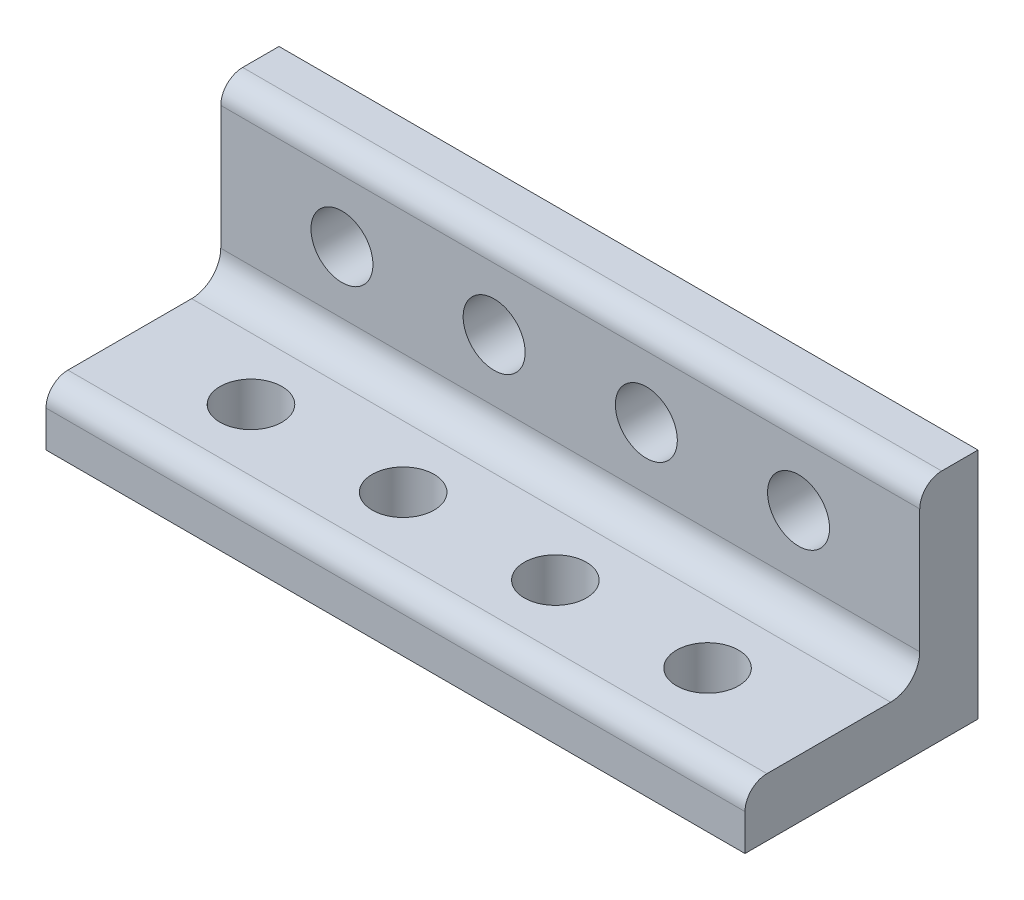
ISO-10303-21;
HEADER;
FILE_DESCRIPTION(('STEP AP214'),'2;1');
FILE_NAME('part.step','',(''),(''),'','','');
FILE_SCHEMA(('AUTOMOTIVE_DESIGN { 1 0 10303 214 1 1 1 1 }'));
ENDSEC;
DATA;
#1=APPLICATION_CONTEXT('core data for automotive mechanical design processes');
#2=APPLICATION_PROTOCOL_DEFINITION('international standard','automotive_design',2000,#1);
#3=PRODUCT_CONTEXT('',#1,'mechanical');
#4=PRODUCT('Part','Part','',(#3));
#5=PRODUCT_RELATED_PRODUCT_CATEGORY('part','',(#4));
#6=PRODUCT_DEFINITION_FORMATION('','',#4);
#7=PRODUCT_DEFINITION_CONTEXT('part definition',#1,'design');
#8=PRODUCT_DEFINITION('design','',#6,#7);
#9=PRODUCT_DEFINITION_SHAPE('','',#8);
#10=(LENGTH_UNIT() NAMED_UNIT(*) SI_UNIT(.MILLI.,.METRE.));
#11=(NAMED_UNIT(*) PLANE_ANGLE_UNIT() SI_UNIT($,.RADIAN.));
#12=(NAMED_UNIT(*) SI_UNIT($,.STERADIAN.) SOLID_ANGLE_UNIT());
#13=UNCERTAINTY_MEASURE_WITH_UNIT(LENGTH_MEASURE(1.E-05),#10,'distance_accuracy_value','');
#14=(GEOMETRIC_REPRESENTATION_CONTEXT(3) GLOBAL_UNCERTAINTY_ASSIGNED_CONTEXT((#13)) GLOBAL_UNIT_ASSIGNED_CONTEXT((#10,
#11,#12)) REPRESENTATION_CONTEXT('',''));
#15=CARTESIAN_POINT('',(0.,0.,0.));
#16=DIRECTION('',(0.,0.,1.));
#17=DIRECTION('',(1.,0.,0.));
#18=AXIS2_PLACEMENT_3D('',#15,#16,#17);
#19=CARTESIAN_POINT('',(0.,6.35,0.));
#20=DIRECTION('',(0.,-1.,0.));
#21=DIRECTION('',(0.,0.,-1.));
#22=AXIS2_PLACEMENT_3D('',#19,#20,#21);
#23=PLANE('',#22);
#24=CARTESIAN_POINT('',(29.80436,6.35,-9.13129999999999));
#25=DIRECTION('',(0.,1.,0.));
#26=DIRECTION('',(0.,0.,1.));
#27=AXIS2_PLACEMENT_3D('',#24,#25,#26);
#28=CIRCLE('',#27,3.3782);
#29=CARTESIAN_POINT('',(29.80436,6.35,-5.75309999999999));
#30=VERTEX_POINT('',#29);
#31=EDGE_CURVE('E304',#30,#30,#28,.T.);
#32=ORIENTED_EDGE('',*,*,#31,.F.);
#33=EDGE_LOOP('',(#32));
#34=FACE_BOUND('',#33,.T.);
#35=CARTESIAN_POINT('',(46.39564,6.35,-9.13129999999999));
#36=DIRECTION('',(0.,1.,0.));
#37=DIRECTION('',(0.,0.,1.));
#38=AXIS2_PLACEMENT_3D('',#35,#36,#37);
#39=CIRCLE('',#38,3.3782);
#40=CARTESIAN_POINT('',(46.39564,6.35,-5.75309999999999));
#41=VERTEX_POINT('',#40);
#42=EDGE_CURVE('E310',#41,#41,#39,.T.);
#43=ORIENTED_EDGE('',*,*,#42,.F.);
#44=EDGE_LOOP('',(#43));
#45=FACE_BOUND('',#44,.T.);
#46=CARTESIAN_POINT('',(62.98692,6.35,-9.13129999999999));
#47=DIRECTION('',(0.,1.,0.));
#48=DIRECTION('',(0.,0.,1.));
#49=AXIS2_PLACEMENT_3D('',#46,#47,#48);
#50=CIRCLE('',#49,3.37819999999999);
#51=CARTESIAN_POINT('',(62.98692,6.35,-5.7531));
#52=VERTEX_POINT('',#51);
#53=EDGE_CURVE('E298',#52,#52,#50,.T.);
#54=ORIENTED_EDGE('',*,*,#53,.F.);
#55=EDGE_LOOP('',(#54));
#56=FACE_BOUND('',#55,.T.);
#57=CARTESIAN_POINT('',(13.21308,6.35,-9.1313));
#58=DIRECTION('',(0.,1.,0.));
#59=DIRECTION('',(0.,0.,1.));
#60=AXIS2_PLACEMENT_3D('',#57,#58,#59);
#61=CIRCLE('',#60,3.37819999999999);
#62=CARTESIAN_POINT('',(13.21308,6.35,-5.7531));
#63=VERTEX_POINT('',#62);
#64=EDGE_CURVE('E133',#63,#63,#61,.T.);
#65=ORIENTED_EDGE('',*,*,#64,.F.);
#66=EDGE_LOOP('',(#65));
#67=FACE_BOUND('',#66,.T.);
#68=DIRECTION('',(0.,0.,1.));
#69=VECTOR('',#68,1.);
#70=CARTESIAN_POINT('',(0.,6.35,0.));
#71=LINE('',#70,#69);
#72=CARTESIAN_POINT('',(0.,6.35,-15.875));
#73=VERTEX_POINT('',#72);
#74=CARTESIAN_POINT('',(0.,6.35,-2.3876));
#75=VERTEX_POINT('',#74);
#76=EDGE_CURVE('E139',#73,#75,#71,.T.);
#77=ORIENTED_EDGE('',*,*,#76,.T.);
#78=DIRECTION('',(1.,0.,0.));
#79=VECTOR('',#78,1.);
#80=CARTESIAN_POINT('',(0.,6.35,-2.3876));
#81=LINE('',#80,#79);
#82=CARTESIAN_POINT('',(76.2,6.35,-2.3876));
#83=VERTEX_POINT('',#82);
#84=EDGE_CURVE('E165',#75,#83,#81,.T.);
#85=ORIENTED_EDGE('',*,*,#84,.T.);
#86=DIRECTION('',(0.,0.,-1.));
#87=VECTOR('',#86,1.);
#88=CARTESIAN_POINT('',(76.2,6.35,0.));
#89=LINE('',#88,#87);
#90=CARTESIAN_POINT('',(76.2,6.35,-15.875));
#91=VERTEX_POINT('',#90);
#92=EDGE_CURVE('E123',#83,#91,#89,.T.);
#93=ORIENTED_EDGE('',*,*,#92,.T.);
#94=DIRECTION('',(1.,0.,0.));
#95=VECTOR('',#94,1.);
#96=CARTESIAN_POINT('',(0.,6.35,-15.875));
#97=LINE('',#96,#95);
#98=EDGE_CURVE('E158',#91,#73,#97,.F.);
#99=ORIENTED_EDGE('',*,*,#98,.T.);
#100=EDGE_LOOP('',(#77,#85,#93,#99));
#101=FACE_BOUND('',#100,.T.);
#102=ADVANCED_FACE('F32',(#34,#45,#56,#67,#101),#23,.F.);
#103=CARTESIAN_POINT('',(0.,6.35,0.));
#104=DIRECTION('',(1.,0.,0.));
#105=DIRECTION('',(0.,0.,-1.));
#106=AXIS2_PLACEMENT_3D('',#103,#104,#105);
#107=PLANE('',#106);
#108=DIRECTION('',(0.,-1.,0.));
#109=VECTOR('',#108,1.);
#110=CARTESIAN_POINT('',(0.,6.35,0.));
#111=LINE('',#110,#109);
#112=CARTESIAN_POINT('',(0.,3.9624,0.));
#113=VERTEX_POINT('',#112);
#114=CARTESIAN_POINT('',(0.,0.,0.));
#115=VERTEX_POINT('',#114);
#116=EDGE_CURVE('E153',#113,#115,#111,.T.);
#117=ORIENTED_EDGE('',*,*,#116,.F.);
#118=CARTESIAN_POINT('',(0.,3.9624,-2.3876));
#119=DIRECTION('',(1.,0.,0.));
#120=DIRECTION('',(0.,0.,-1.));
#121=AXIS2_PLACEMENT_3D('',#118,#119,#120);
#122=CIRCLE('',#121,2.3876);
#123=EDGE_CURVE('E175',#113,#75,#122,.F.);
#124=ORIENTED_EDGE('',*,*,#123,.T.);
#125=ORIENTED_EDGE('',*,*,#76,.F.);
#126=CARTESIAN_POINT('',(0.,9.525,-15.875));
#127=DIRECTION('',(1.,0.,0.));
#128=DIRECTION('',(0.,0.,-1.));
#129=AXIS2_PLACEMENT_3D('',#126,#127,#128);
#130=CIRCLE('',#129,3.175);
#131=CARTESIAN_POINT('',(0.,9.525,-19.05));
#132=VERTEX_POINT('',#131);
#133=EDGE_CURVE('E163',#73,#132,#130,.T.);
#134=ORIENTED_EDGE('',*,*,#133,.T.);
#135=DIRECTION('',(0.,1.,0.));
#136=VECTOR('',#135,1.);
#137=CARTESIAN_POINT('',(0.,0.,-19.05));
#138=LINE('',#137,#136);
#139=CARTESIAN_POINT('',(0.,23.0124,-19.05));
#140=VERTEX_POINT('',#139);
#141=EDGE_CURVE('E128',#132,#140,#138,.T.);
#142=ORIENTED_EDGE('',*,*,#141,.T.);
#143=CARTESIAN_POINT('',(0.,23.0124,-21.4376));
#144=DIRECTION('',(1.,0.,0.));
#145=DIRECTION('',(0.,0.,-1.));
#146=AXIS2_PLACEMENT_3D('',#143,#144,#145);
#147=CIRCLE('',#146,2.3876);
#148=CARTESIAN_POINT('',(0.,25.4,-21.4376));
#149=VERTEX_POINT('',#148);
#150=EDGE_CURVE('E47',#140,#149,#147,.F.);
#151=ORIENTED_EDGE('',*,*,#150,.T.);
#152=DIRECTION('',(0.,0.,-1.));
#153=VECTOR('',#152,1.);
#154=CARTESIAN_POINT('',(0.,25.4,-19.05));
#155=LINE('',#154,#153);
#156=CARTESIAN_POINT('',(0.,25.4,-25.4));
#157=VERTEX_POINT('',#156);
#158=EDGE_CURVE('E101',#149,#157,#155,.T.);
#159=ORIENTED_EDGE('',*,*,#158,.T.);
#160=DIRECTION('',(0.,-1.,0.));
#161=VECTOR('',#160,1.);
#162=CARTESIAN_POINT('',(0.,6.35,-25.4));
#163=LINE('',#162,#161);
#164=CARTESIAN_POINT('',(0.,0.,-25.4));
#165=VERTEX_POINT('',#164);
#166=EDGE_CURVE('E106',#157,#165,#163,.T.);
#167=ORIENTED_EDGE('',*,*,#166,.T.);
#168=DIRECTION('',(0.,0.,1.));
#169=VECTOR('',#168,1.);
#170=CARTESIAN_POINT('',(0.,0.,0.));
#171=LINE('',#170,#169);
#172=EDGE_CURVE('E137',#165,#115,#171,.T.);
#173=ORIENTED_EDGE('',*,*,#172,.T.);
#174=EDGE_LOOP('',(#117,#124,#125,#134,#142,#151,#159,#167,#173));
#175=FACE_BOUND('',#174,.T.);
#176=ADVANCED_FACE('F104',(#175),#107,.F.);
#177=CARTESIAN_POINT('',(0.,6.35,0.));
#178=DIRECTION('',(0.,0.,-1.));
#179=DIRECTION('',(-1.,0.,0.));
#180=AXIS2_PLACEMENT_3D('',#177,#178,#179);
#181=PLANE('',#180);
#182=DIRECTION('',(0.,-1.,0.));
#183=VECTOR('',#182,1.);
#184=CARTESIAN_POINT('',(76.2,6.35,0.));
#185=LINE('',#184,#183);
#186=CARTESIAN_POINT('',(76.2,3.9624,0.));
#187=VERTEX_POINT('',#186);
#188=CARTESIAN_POINT('',(76.2,0.,0.));
#189=VERTEX_POINT('',#188);
#190=EDGE_CURVE('E151',#187,#189,#185,.T.);
#191=ORIENTED_EDGE('',*,*,#190,.F.);
#192=DIRECTION('',(1.,0.,0.));
#193=VECTOR('',#192,1.);
#194=CARTESIAN_POINT('',(0.,3.9624,0.));
#195=LINE('',#194,#193);
#196=EDGE_CURVE('E172',#187,#113,#195,.F.);
#197=ORIENTED_EDGE('',*,*,#196,.T.);
#198=ORIENTED_EDGE('',*,*,#116,.T.);
#199=DIRECTION('',(1.,0.,0.));
#200=VECTOR('',#199,1.);
#201=CARTESIAN_POINT('',(0.,0.,0.));
#202=LINE('',#201,#200);
#203=EDGE_CURVE('E144',#115,#189,#202,.T.);
#204=ORIENTED_EDGE('',*,*,#203,.T.);
#205=EDGE_LOOP('',(#191,#197,#198,#204));
#206=FACE_BOUND('',#205,.T.);
#207=ADVANCED_FACE('F215',(#206),#181,.F.);
#208=CARTESIAN_POINT('',(76.2,6.35,0.));
#209=DIRECTION('',(-1.,0.,0.));
#210=DIRECTION('',(0.,0.,1.));
#211=AXIS2_PLACEMENT_3D('',#208,#209,#210);
#212=PLANE('',#211);
#213=ORIENTED_EDGE('',*,*,#92,.F.);
#214=CARTESIAN_POINT('',(76.2,3.9624,-2.3876));
#215=DIRECTION('',(-1.,0.,0.));
#216=DIRECTION('',(0.,0.,1.));
#217=AXIS2_PLACEMENT_3D('',#214,#215,#216);
#218=CIRCLE('',#217,2.3876);
#219=EDGE_CURVE('E170',#83,#187,#218,.F.);
#220=ORIENTED_EDGE('',*,*,#219,.T.);
#221=ORIENTED_EDGE('',*,*,#190,.T.);
#222=DIRECTION('',(0.,0.,-1.));
#223=VECTOR('',#222,1.);
#224=CARTESIAN_POINT('',(76.2,0.,0.));
#225=LINE('',#224,#223);
#226=CARTESIAN_POINT('',(76.2,0.,-25.4));
#227=VERTEX_POINT('',#226);
#228=EDGE_CURVE('E147',#189,#227,#225,.T.);
#229=ORIENTED_EDGE('',*,*,#228,.T.);
#230=DIRECTION('',(0.,-1.,0.));
#231=VECTOR('',#230,1.);
#232=CARTESIAN_POINT('',(76.2,6.35,-25.4));
#233=LINE('',#232,#231);
#234=CARTESIAN_POINT('',(76.2,25.4,-25.4));
#235=VERTEX_POINT('',#234);
#236=EDGE_CURVE('E122',#235,#227,#233,.T.);
#237=ORIENTED_EDGE('',*,*,#236,.F.);
#238=DIRECTION('',(0.,0.,-1.));
#239=VECTOR('',#238,1.);
#240=CARTESIAN_POINT('',(76.2,25.4,-19.05));
#241=LINE('',#240,#239);
#242=CARTESIAN_POINT('',(76.2,25.4,-21.4376));
#243=VERTEX_POINT('',#242);
#244=EDGE_CURVE('E112',#243,#235,#241,.T.);
#245=ORIENTED_EDGE('',*,*,#244,.F.);
#246=CARTESIAN_POINT('',(76.2,23.0124,-21.4376));
#247=DIRECTION('',(-1.,0.,0.));
#248=DIRECTION('',(0.,0.,1.));
#249=AXIS2_PLACEMENT_3D('',#246,#247,#248);
#250=CIRCLE('',#249,2.3876);
#251=CARTESIAN_POINT('',(76.2,23.0124,-19.05));
#252=VERTEX_POINT('',#251);
#253=EDGE_CURVE('E168',#243,#252,#250,.F.);
#254=ORIENTED_EDGE('',*,*,#253,.T.);
#255=DIRECTION('',(0.,-1.,0.));
#256=VECTOR('',#255,1.);
#257=CARTESIAN_POINT('',(76.2,0.,-19.05));
#258=LINE('',#257,#256);
#259=CARTESIAN_POINT('',(76.2,9.525,-19.05));
#260=VERTEX_POINT('',#259);
#261=EDGE_CURVE('E113',#252,#260,#258,.T.);
#262=ORIENTED_EDGE('',*,*,#261,.T.);
#263=CARTESIAN_POINT('',(76.2,9.525,-15.875));
#264=DIRECTION('',(-1.,0.,0.));
#265=DIRECTION('',(0.,0.,1.));
#266=AXIS2_PLACEMENT_3D('',#263,#264,#265);
#267=CIRCLE('',#266,3.175);
#268=EDGE_CURVE('E160',#260,#91,#267,.T.);
#269=ORIENTED_EDGE('',*,*,#268,.T.);
#270=EDGE_LOOP('',(#213,#220,#221,#229,#237,#245,#254,#262,#269));
#271=FACE_BOUND('',#270,.T.);
#272=ADVANCED_FACE('F179',(#271),#212,.F.);
#273=CARTESIAN_POINT('',(0.,6.35,-25.4));
#274=DIRECTION('',(0.,0.,1.));
#275=DIRECTION('',(1.,0.,0.));
#276=AXIS2_PLACEMENT_3D('',#273,#274,#275);
#277=PLANE('',#276);
#278=CARTESIAN_POINT('',(29.80436,16.2687,-25.4));
#279=DIRECTION('',(0.,0.,1.));
#280=DIRECTION('',(1.,0.,0.));
#281=AXIS2_PLACEMENT_3D('',#278,#279,#280);
#282=CIRCLE('',#281,3.3782);
#283=CARTESIAN_POINT('',(33.18256,16.2687,-25.4));
#284=VERTEX_POINT('',#283);
#285=EDGE_CURVE('E276',#284,#284,#282,.T.);
#286=ORIENTED_EDGE('',*,*,#285,.T.);
#287=EDGE_LOOP('',(#286));
#288=FACE_BOUND('',#287,.T.);
#289=CARTESIAN_POINT('',(46.39564,16.2687,-25.4));
#290=DIRECTION('',(0.,0.,1.));
#291=DIRECTION('',(1.,0.,0.));
#292=AXIS2_PLACEMENT_3D('',#289,#290,#291);
#293=CIRCLE('',#292,3.3782);
#294=CARTESIAN_POINT('',(49.77384,16.2687,-25.4));
#295=VERTEX_POINT('',#294);
#296=EDGE_CURVE('E279',#295,#295,#293,.T.);
#297=ORIENTED_EDGE('',*,*,#296,.T.);
#298=EDGE_LOOP('',(#297));
#299=FACE_BOUND('',#298,.T.);
#300=CARTESIAN_POINT('',(62.98692,16.2687,-25.4));
#301=DIRECTION('',(0.,0.,1.));
#302=DIRECTION('',(1.,0.,0.));
#303=AXIS2_PLACEMENT_3D('',#300,#301,#302);
#304=CIRCLE('',#303,3.37819999999999);
#305=CARTESIAN_POINT('',(66.36512,16.2687,-25.4));
#306=VERTEX_POINT('',#305);
#307=EDGE_CURVE('E289',#306,#306,#304,.T.);
#308=ORIENTED_EDGE('',*,*,#307,.T.);
#309=EDGE_LOOP('',(#308));
#310=FACE_BOUND('',#309,.T.);
#311=CARTESIAN_POINT('',(13.21308,16.2687,-25.4));
#312=DIRECTION('',(0.,0.,1.));
#313=DIRECTION('',(1.,0.,0.));
#314=AXIS2_PLACEMENT_3D('',#311,#312,#313);
#315=CIRCLE('',#314,3.3782);
#316=CARTESIAN_POINT('',(16.59128,16.2687,-25.4));
#317=VERTEX_POINT('',#316);
#318=EDGE_CURVE('E295',#317,#317,#315,.T.);
#319=ORIENTED_EDGE('',*,*,#318,.T.);
#320=EDGE_LOOP('',(#319));
#321=FACE_BOUND('',#320,.T.);
#322=DIRECTION('',(-1.,0.,0.));
#323=VECTOR('',#322,1.);
#324=CARTESIAN_POINT('',(0.,0.,-25.4));
#325=LINE('',#324,#323);
#326=EDGE_CURVE('E121',#227,#165,#325,.T.);
#327=ORIENTED_EDGE('',*,*,#326,.T.);
#328=ORIENTED_EDGE('',*,*,#166,.F.);
#329=DIRECTION('',(1.,0.,0.));
#330=VECTOR('',#329,1.);
#331=CARTESIAN_POINT('',(0.,25.4,-25.4));
#332=LINE('',#331,#330);
#333=EDGE_CURVE('E119',#157,#235,#332,.T.);
#334=ORIENTED_EDGE('',*,*,#333,.T.);
#335=ORIENTED_EDGE('',*,*,#236,.T.);
#336=EDGE_LOOP('',(#327,#328,#334,#335));
#337=FACE_BOUND('',#336,.T.);
#338=ADVANCED_FACE('F117',(#288,#299,#310,#321,#337),#277,.F.);
#339=CARTESIAN_POINT('',(0.,0.,0.));
#340=DIRECTION('',(0.,-1.,0.));
#341=DIRECTION('',(0.,0.,-1.));
#342=AXIS2_PLACEMENT_3D('',#339,#340,#341);
#343=PLANE('',#342);
#344=CARTESIAN_POINT('',(29.80436,0.,-9.13129999999999));
#345=DIRECTION('',(0.,1.,0.));
#346=DIRECTION('',(0.,0.,1.));
#347=AXIS2_PLACEMENT_3D('',#344,#345,#346);
#348=CIRCLE('',#347,3.3782);
#349=CARTESIAN_POINT('',(29.80436,0.,-5.75309999999999));
#350=VERTEX_POINT('',#349);
#351=EDGE_CURVE('E301',#350,#350,#348,.T.);
#352=ORIENTED_EDGE('',*,*,#351,.T.);
#353=EDGE_LOOP('',(#352));
#354=FACE_BOUND('',#353,.T.);
#355=CARTESIAN_POINT('',(46.39564,0.,-9.13129999999999));
#356=DIRECTION('',(0.,1.,0.));
#357=DIRECTION('',(0.,0.,1.));
#358=AXIS2_PLACEMENT_3D('',#355,#356,#357);
#359=CIRCLE('',#358,3.3782);
#360=CARTESIAN_POINT('',(46.39564,0.,-5.75309999999999));
#361=VERTEX_POINT('',#360);
#362=EDGE_CURVE('E307',#361,#361,#359,.T.);
#363=ORIENTED_EDGE('',*,*,#362,.T.);
#364=EDGE_LOOP('',(#363));
#365=FACE_BOUND('',#364,.T.);
#366=CARTESIAN_POINT('',(62.98692,0.,-9.13129999999999));
#367=DIRECTION('',(0.,1.,0.));
#368=DIRECTION('',(0.,0.,1.));
#369=AXIS2_PLACEMENT_3D('',#366,#367,#368);
#370=CIRCLE('',#369,3.37819999999999);
#371=CARTESIAN_POINT('',(62.98692,0.,-5.7531));
#372=VERTEX_POINT('',#371);
#373=EDGE_CURVE('E313',#372,#372,#370,.T.);
#374=ORIENTED_EDGE('',*,*,#373,.T.);
#375=EDGE_LOOP('',(#374));
#376=FACE_BOUND('',#375,.T.);
#377=CARTESIAN_POINT('',(13.21308,0.,-9.1313));
#378=DIRECTION('',(0.,1.,0.));
#379=DIRECTION('',(0.,0.,1.));
#380=AXIS2_PLACEMENT_3D('',#377,#378,#379);
#381=CIRCLE('',#380,3.37819999999999);
#382=CARTESIAN_POINT('',(13.21308,0.,-5.7531));
#383=VERTEX_POINT('',#382);
#384=EDGE_CURVE('E129',#383,#383,#381,.T.);
#385=ORIENTED_EDGE('',*,*,#384,.T.);
#386=EDGE_LOOP('',(#385));
#387=FACE_BOUND('',#386,.T.);
#388=ORIENTED_EDGE('',*,*,#326,.F.);
#389=ORIENTED_EDGE('',*,*,#228,.F.);
#390=ORIENTED_EDGE('',*,*,#203,.F.);
#391=ORIENTED_EDGE('',*,*,#172,.F.);
#392=EDGE_LOOP('',(#388,#389,#390,#391));
#393=FACE_BOUND('',#392,.T.);
#394=ADVANCED_FACE('F182',(#354,#365,#376,#387,#393),#343,.T.);
#395=CARTESIAN_POINT('',(0.,0.,-19.05));
#396=DIRECTION('',(0.,0.,-1.));
#397=DIRECTION('',(-1.,0.,0.));
#398=AXIS2_PLACEMENT_3D('',#395,#396,#397);
#399=PLANE('',#398);
#400=CARTESIAN_POINT('',(29.80436,16.2687,-19.05));
#401=DIRECTION('',(0.,0.,1.));
#402=DIRECTION('',(1.,0.,0.));
#403=AXIS2_PLACEMENT_3D('',#400,#401,#402);
#404=CIRCLE('',#403,3.3782);
#405=CARTESIAN_POINT('',(33.18256,16.2687,-19.05));
#406=VERTEX_POINT('',#405);
#407=EDGE_CURVE('E278',#406,#406,#404,.T.);
#408=ORIENTED_EDGE('',*,*,#407,.F.);
#409=EDGE_LOOP('',(#408));
#410=FACE_BOUND('',#409,.T.);
#411=CARTESIAN_POINT('',(46.39564,16.2687,-19.05));
#412=DIRECTION('',(0.,0.,1.));
#413=DIRECTION('',(1.,0.,0.));
#414=AXIS2_PLACEMENT_3D('',#411,#412,#413);
#415=CIRCLE('',#414,3.3782);
#416=CARTESIAN_POINT('',(49.77384,16.2687,-19.05));
#417=VERTEX_POINT('',#416);
#418=EDGE_CURVE('E284',#417,#417,#415,.T.);
#419=ORIENTED_EDGE('',*,*,#418,.F.);
#420=EDGE_LOOP('',(#419));
#421=FACE_BOUND('',#420,.T.);
#422=CARTESIAN_POINT('',(62.98692,16.2687,-19.05));
#423=DIRECTION('',(0.,0.,1.));
#424=DIRECTION('',(1.,0.,0.));
#425=AXIS2_PLACEMENT_3D('',#422,#423,#424);
#426=CIRCLE('',#425,3.37819999999999);
#427=CARTESIAN_POINT('',(66.36512,16.2687,-19.05));
#428=VERTEX_POINT('',#427);
#429=EDGE_CURVE('E292',#428,#428,#426,.T.);
#430=ORIENTED_EDGE('',*,*,#429,.F.);
#431=EDGE_LOOP('',(#430));
#432=FACE_BOUND('',#431,.T.);
#433=CARTESIAN_POINT('',(13.21308,16.2687,-19.05));
#434=DIRECTION('',(0.,0.,1.));
#435=DIRECTION('',(1.,0.,0.));
#436=AXIS2_PLACEMENT_3D('',#433,#434,#435);
#437=CIRCLE('',#436,3.3782);
#438=CARTESIAN_POINT('',(16.59128,16.2687,-19.05));
#439=VERTEX_POINT('',#438);
#440=EDGE_CURVE('E281',#439,#439,#437,.T.);
#441=ORIENTED_EDGE('',*,*,#440,.F.);
#442=EDGE_LOOP('',(#441));
#443=FACE_BOUND('',#442,.T.);
#444=ORIENTED_EDGE('',*,*,#261,.F.);
#445=DIRECTION('',(1.,0.,0.));
#446=VECTOR('',#445,1.);
#447=CARTESIAN_POINT('',(0.,23.0124,-19.05));
#448=LINE('',#447,#446);
#449=EDGE_CURVE('E11',#252,#140,#448,.F.);
#450=ORIENTED_EDGE('',*,*,#449,.T.);
#451=ORIENTED_EDGE('',*,*,#141,.F.);
#452=DIRECTION('',(1.,0.,0.));
#453=VECTOR('',#452,1.);
#454=CARTESIAN_POINT('',(76.2,9.525,-19.05));
#455=LINE('',#454,#453);
#456=EDGE_CURVE('E155',#132,#260,#455,.T.);
#457=ORIENTED_EDGE('',*,*,#456,.T.);
#458=EDGE_LOOP('',(#444,#450,#451,#457));
#459=FACE_BOUND('',#458,.T.);
#460=ADVANCED_FACE('F199',(#410,#421,#432,#443,#459),#399,.F.);
#461=CARTESIAN_POINT('',(0.,25.4,-19.05));
#462=DIRECTION('',(0.,1.,0.));
#463=DIRECTION('',(-1.,0.,0.));
#464=AXIS2_PLACEMENT_3D('',#461,#462,#463);
#465=PLANE('',#464);
#466=ORIENTED_EDGE('',*,*,#158,.F.);
#467=DIRECTION('',(1.,0.,0.));
#468=VECTOR('',#467,1.);
#469=CARTESIAN_POINT('',(76.2,25.4,-21.4376));
#470=LINE('',#469,#468);
#471=EDGE_CURVE('E40',#149,#243,#470,.T.);
#472=ORIENTED_EDGE('',*,*,#471,.T.);
#473=ORIENTED_EDGE('',*,*,#244,.T.);
#474=ORIENTED_EDGE('',*,*,#333,.F.);
#475=EDGE_LOOP('',(#466,#472,#473,#474));
#476=FACE_BOUND('',#475,.T.);
#477=ADVANCED_FACE('F125',(#476),#465,.T.);
#478=CARTESIAN_POINT('',(0.,9.525,-15.875));
#479=DIRECTION('',(-1.,0.,0.));
#480=DIRECTION('',(0.,0.,1.));
#481=AXIS2_PLACEMENT_3D('',#478,#479,#480);
#482=CYLINDRICAL_SURFACE('',#481,3.175);
#483=ORIENTED_EDGE('',*,*,#133,.F.);
#484=ORIENTED_EDGE('',*,*,#98,.F.);
#485=ORIENTED_EDGE('',*,*,#268,.F.);
#486=ORIENTED_EDGE('',*,*,#456,.F.);
#487=EDGE_LOOP('',(#483,#484,#485,#486));
#488=FACE_BOUND('',#487,.T.);
#489=ADVANCED_FACE('F198',(#488),#482,.F.);
#490=CARTESIAN_POINT('',(0.,3.9624,-2.3876));
#491=DIRECTION('',(1.,0.,0.));
#492=DIRECTION('',(0.,0.,-1.));
#493=AXIS2_PLACEMENT_3D('',#490,#491,#492);
#494=CYLINDRICAL_SURFACE('',#493,2.3876);
#495=ORIENTED_EDGE('',*,*,#123,.F.);
#496=ORIENTED_EDGE('',*,*,#196,.F.);
#497=ORIENTED_EDGE('',*,*,#219,.F.);
#498=ORIENTED_EDGE('',*,*,#84,.F.);
#499=EDGE_LOOP('',(#495,#496,#497,#498));
#500=FACE_BOUND('',#499,.T.);
#501=ADVANCED_FACE('F190',(#500),#494,.T.);
#502=CARTESIAN_POINT('',(0.,23.0124,-21.4376));
#503=DIRECTION('',(-1.,0.,0.));
#504=DIRECTION('',(0.,-1.,0.));
#505=AXIS2_PLACEMENT_3D('',#502,#503,#504);
#506=CYLINDRICAL_SURFACE('',#505,2.3876);
#507=ORIENTED_EDGE('',*,*,#150,.F.);
#508=ORIENTED_EDGE('',*,*,#449,.F.);
#509=ORIENTED_EDGE('',*,*,#253,.F.);
#510=ORIENTED_EDGE('',*,*,#471,.F.);
#511=EDGE_LOOP('',(#507,#508,#509,#510));
#512=FACE_BOUND('',#511,.T.);
#513=ADVANCED_FACE('F34',(#512),#506,.T.);
#514=CARTESIAN_POINT('',(13.21308,0.,-9.1313));
#515=DIRECTION('',(0.,1.,0.));
#516=DIRECTION('',(0.,0.,1.));
#517=AXIS2_PLACEMENT_3D('',#514,#515,#516);
#518=CYLINDRICAL_SURFACE('',#517,3.37819999999999);
#519=ORIENTED_EDGE('',*,*,#384,.F.);
#520=EDGE_LOOP('',(#519));
#521=FACE_BOUND('',#520,.T.);
#522=ORIENTED_EDGE('',*,*,#64,.T.);
#523=EDGE_LOOP('',(#522));
#524=FACE_BOUND('',#523,.T.);
#525=ADVANCED_FACE('F201',(#521,#524),#518,.F.);
#526=CARTESIAN_POINT('',(62.98692,0.,-9.13129999999999));
#527=DIRECTION('',(0.,1.,0.));
#528=DIRECTION('',(0.,0.,1.));
#529=AXIS2_PLACEMENT_3D('',#526,#527,#528);
#530=CYLINDRICAL_SURFACE('',#529,3.37819999999999);
#531=ORIENTED_EDGE('',*,*,#373,.F.);
#532=EDGE_LOOP('',(#531));
#533=FACE_BOUND('',#532,.T.);
#534=ORIENTED_EDGE('',*,*,#53,.T.);
#535=EDGE_LOOP('',(#534));
#536=FACE_BOUND('',#535,.T.);
#537=ADVANCED_FACE('F206',(#533,#536),#530,.F.);
#538=CARTESIAN_POINT('',(46.39564,0.,-9.13129999999999));
#539=DIRECTION('',(0.,1.,0.));
#540=DIRECTION('',(0.,0.,1.));
#541=AXIS2_PLACEMENT_3D('',#538,#539,#540);
#542=CYLINDRICAL_SURFACE('',#541,3.3782);
#543=ORIENTED_EDGE('',*,*,#362,.F.);
#544=EDGE_LOOP('',(#543));
#545=FACE_BOUND('',#544,.T.);
#546=ORIENTED_EDGE('',*,*,#42,.T.);
#547=EDGE_LOOP('',(#546));
#548=FACE_BOUND('',#547,.T.);
#549=ADVANCED_FACE('F247',(#545,#548),#542,.F.);
#550=CARTESIAN_POINT('',(29.80436,0.,-9.13129999999999));
#551=DIRECTION('',(0.,1.,0.));
#552=DIRECTION('',(0.,0.,1.));
#553=AXIS2_PLACEMENT_3D('',#550,#551,#552);
#554=CYLINDRICAL_SURFACE('',#553,3.3782);
#555=ORIENTED_EDGE('',*,*,#351,.F.);
#556=EDGE_LOOP('',(#555));
#557=FACE_BOUND('',#556,.T.);
#558=ORIENTED_EDGE('',*,*,#31,.T.);
#559=EDGE_LOOP('',(#558));
#560=FACE_BOUND('',#559,.T.);
#561=ADVANCED_FACE('F251',(#557,#560),#554,.F.);
#562=CARTESIAN_POINT('',(13.21308,16.2687,-25.4));
#563=DIRECTION('',(0.,0.,1.));
#564=DIRECTION('',(1.,0.,0.));
#565=AXIS2_PLACEMENT_3D('',#562,#563,#564);
#566=CYLINDRICAL_SURFACE('',#565,3.3782);
#567=ORIENTED_EDGE('',*,*,#318,.F.);
#568=EDGE_LOOP('',(#567));
#569=FACE_BOUND('',#568,.T.);
#570=ORIENTED_EDGE('',*,*,#440,.T.);
#571=EDGE_LOOP('',(#570));
#572=FACE_BOUND('',#571,.T.);
#573=ADVANCED_FACE('F255',(#569,#572),#566,.F.);
#574=CARTESIAN_POINT('',(62.98692,16.2687,-25.4));
#575=DIRECTION('',(0.,0.,1.));
#576=DIRECTION('',(1.,0.,0.));
#577=AXIS2_PLACEMENT_3D('',#574,#575,#576);
#578=CYLINDRICAL_SURFACE('',#577,3.37819999999999);
#579=ORIENTED_EDGE('',*,*,#307,.F.);
#580=EDGE_LOOP('',(#579));
#581=FACE_BOUND('',#580,.T.);
#582=ORIENTED_EDGE('',*,*,#429,.T.);
#583=EDGE_LOOP('',(#582));
#584=FACE_BOUND('',#583,.T.);
#585=ADVANCED_FACE('F259',(#581,#584),#578,.F.);
#586=CARTESIAN_POINT('',(46.39564,16.2687,-25.4));
#587=DIRECTION('',(0.,0.,1.));
#588=DIRECTION('',(1.,0.,0.));
#589=AXIS2_PLACEMENT_3D('',#586,#587,#588);
#590=CYLINDRICAL_SURFACE('',#589,3.3782);
#591=ORIENTED_EDGE('',*,*,#296,.F.);
#592=EDGE_LOOP('',(#591));
#593=FACE_BOUND('',#592,.T.);
#594=ORIENTED_EDGE('',*,*,#418,.T.);
#595=EDGE_LOOP('',(#594));
#596=FACE_BOUND('',#595,.T.);
#597=ADVANCED_FACE('F263',(#593,#596),#590,.F.);
#598=CARTESIAN_POINT('',(29.80436,16.2687,-25.4));
#599=DIRECTION('',(0.,0.,1.));
#600=DIRECTION('',(1.,0.,0.));
#601=AXIS2_PLACEMENT_3D('',#598,#599,#600);
#602=CYLINDRICAL_SURFACE('',#601,3.3782);
#603=ORIENTED_EDGE('',*,*,#285,.F.);
#604=EDGE_LOOP('',(#603));
#605=FACE_BOUND('',#604,.T.);
#606=ORIENTED_EDGE('',*,*,#407,.T.);
#607=EDGE_LOOP('',(#606));
#608=FACE_BOUND('',#607,.T.);
#609=ADVANCED_FACE('F267',(#605,#608),#602,.F.);
#610=CLOSED_SHELL('',(#102,#176,#207,#272,#338,#394,#460,#477,#489,#501,#513,#525,#537,#549,
#561,#573,#585,#597,#609));
#611=MANIFOLD_SOLID_BREP('B2',#610);
#612=ADVANCED_BREP_SHAPE_REPRESENTATION('',(#18,#611),#14);
#613=SHAPE_DEFINITION_REPRESENTATION(#9,#612);
ENDSEC;
END-ISO-10303-21;
